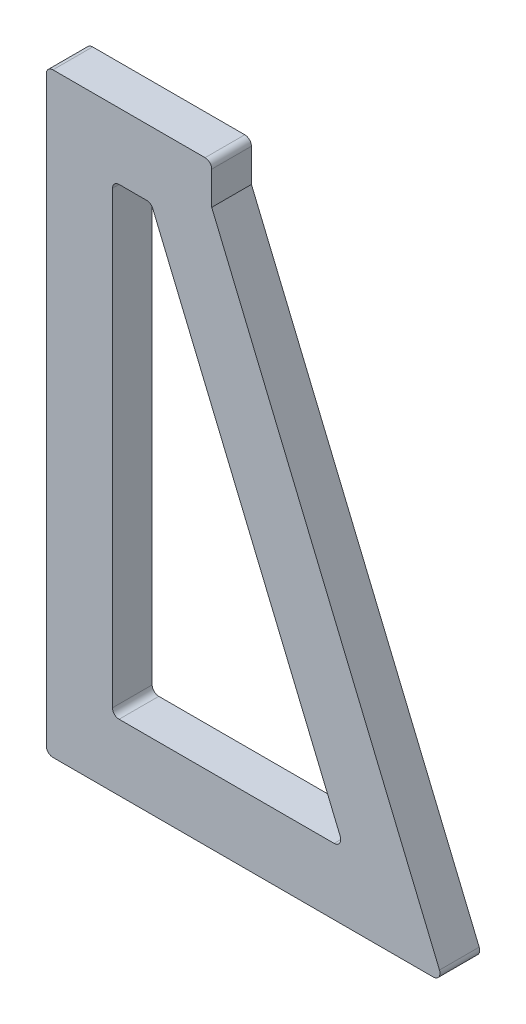
ISO-10303-21;
HEADER;
FILE_DESCRIPTION(('STEP AP214'),'2;1');
FILE_NAME('part.step','',(''),(''),'','','');
FILE_SCHEMA(('AUTOMOTIVE_DESIGN { 1 0 10303 214 1 1 1 1 }'));
ENDSEC;
DATA;
#1=APPLICATION_CONTEXT('core data for automotive mechanical design processes');
#2=APPLICATION_PROTOCOL_DEFINITION('international standard','automotive_design',2000,#1);
#3=PRODUCT_CONTEXT('',#1,'mechanical');
#4=PRODUCT('Part','Part','',(#3));
#5=PRODUCT_RELATED_PRODUCT_CATEGORY('part','',(#4));
#6=PRODUCT_DEFINITION_FORMATION('','',#4);
#7=PRODUCT_DEFINITION_CONTEXT('part definition',#1,'design');
#8=PRODUCT_DEFINITION('design','',#6,#7);
#9=PRODUCT_DEFINITION_SHAPE('','',#8);
#10=(LENGTH_UNIT() NAMED_UNIT(*) SI_UNIT(.MILLI.,.METRE.));
#11=(NAMED_UNIT(*) PLANE_ANGLE_UNIT() SI_UNIT($,.RADIAN.));
#12=(NAMED_UNIT(*) SI_UNIT($,.STERADIAN.) SOLID_ANGLE_UNIT());
#13=UNCERTAINTY_MEASURE_WITH_UNIT(LENGTH_MEASURE(1.E-05),#10,'distance_accuracy_value','');
#14=(GEOMETRIC_REPRESENTATION_CONTEXT(3) GLOBAL_UNCERTAINTY_ASSIGNED_CONTEXT((#13)) GLOBAL_UNIT_ASSIGNED_CONTEXT((#10,
#11,#12)) REPRESENTATION_CONTEXT('',''));
#15=CARTESIAN_POINT('',(0.,0.,0.));
#16=DIRECTION('',(0.,0.,1.));
#17=DIRECTION('',(1.,0.,0.));
#18=AXIS2_PLACEMENT_3D('',#15,#16,#17);
#19=CARTESIAN_POINT('',(58.5,1.,6.));
#20=DIRECTION('',(0.,0.,-1.));
#21=DIRECTION('',(-1.,0.,0.));
#22=AXIS2_PLACEMENT_3D('',#19,#20,#21);
#23=PLANE('',#22);
#24=DIRECTION('',(-0.384615384615385,0.923076923076923,0.));
#25=VECTOR('',#24,1.);
#26=CARTESIAN_POINT('',(25.,84.,6.));
#27=LINE('',#26,#25);
#28=CARTESIAN_POINT('',(59.4230769230769,1.38461538461538,6.));
#29=VERTEX_POINT('',#28);
#30=CARTESIAN_POINT('',(25.,84.,6.));
#31=VERTEX_POINT('',#30);
#32=EDGE_CURVE('E217',#29,#31,#27,.T.);
#33=ORIENTED_EDGE('',*,*,#32,.T.);
#34=DIRECTION('',(0.,1.,0.));
#35=VECTOR('',#34,1.);
#36=CARTESIAN_POINT('',(25.,89.,6.));
#37=LINE('',#36,#35);
#38=CARTESIAN_POINT('',(25.,89.,6.));
#39=VERTEX_POINT('',#38);
#40=EDGE_CURVE('E220',#31,#39,#37,.T.);
#41=ORIENTED_EDGE('',*,*,#40,.T.);
#42=CARTESIAN_POINT('',(24.,89.,6.));
#43=DIRECTION('',(0.,0.,1.));
#44=DIRECTION('',(1.,0.,0.));
#45=AXIS2_PLACEMENT_3D('',#42,#43,#44);
#46=CIRCLE('',#45,0.999999999999999);
#47=CARTESIAN_POINT('',(24.,90.,6.));
#48=VERTEX_POINT('',#47);
#49=EDGE_CURVE('E223',#39,#48,#46,.T.);
#50=ORIENTED_EDGE('',*,*,#49,.T.);
#51=DIRECTION('',(-1.,0.,0.));
#52=VECTOR('',#51,1.);
#53=CARTESIAN_POINT('',(1.,90.,6.));
#54=LINE('',#53,#52);
#55=CARTESIAN_POINT('',(1.,90.,6.));
#56=VERTEX_POINT('',#55);
#57=EDGE_CURVE('E225',#48,#56,#54,.T.);
#58=ORIENTED_EDGE('',*,*,#57,.T.);
#59=CARTESIAN_POINT('',(1.,89.,6.));
#60=DIRECTION('',(0.,0.,1.));
#61=DIRECTION('',(-1.,0.,0.));
#62=AXIS2_PLACEMENT_3D('',#59,#60,#61);
#63=CIRCLE('',#62,1.);
#64=CARTESIAN_POINT('',(0.,89.,6.));
#65=VERTEX_POINT('',#64);
#66=EDGE_CURVE('E227',#56,#65,#63,.T.);
#67=ORIENTED_EDGE('',*,*,#66,.T.);
#68=DIRECTION('',(0.,-1.,0.));
#69=VECTOR('',#68,1.);
#70=CARTESIAN_POINT('',(0.,1.00000000000001,6.));
#71=LINE('',#70,#69);
#72=CARTESIAN_POINT('',(0.,1.00000000000001,6.));
#73=VERTEX_POINT('',#72);
#74=EDGE_CURVE('E229',#65,#73,#71,.T.);
#75=ORIENTED_EDGE('',*,*,#74,.T.);
#76=CARTESIAN_POINT('',(1.,1.,6.));
#77=DIRECTION('',(0.,0.,1.));
#78=DIRECTION('',(1.,0.,0.));
#79=AXIS2_PLACEMENT_3D('',#76,#77,#78);
#80=CIRCLE('',#79,1.);
#81=CARTESIAN_POINT('',(1.00000000000001,0.,6.));
#82=VERTEX_POINT('',#81);
#83=EDGE_CURVE('E231',#73,#82,#80,.T.);
#84=ORIENTED_EDGE('',*,*,#83,.T.);
#85=DIRECTION('',(1.,0.,0.));
#86=VECTOR('',#85,1.);
#87=CARTESIAN_POINT('',(58.5,0.,6.));
#88=LINE('',#87,#86);
#89=CARTESIAN_POINT('',(58.5,0.,6.));
#90=VERTEX_POINT('',#89);
#91=EDGE_CURVE('E233',#82,#90,#88,.T.);
#92=ORIENTED_EDGE('',*,*,#91,.T.);
#93=CARTESIAN_POINT('',(58.5,1.,6.));
#94=DIRECTION('',(0.,0.,1.));
#95=DIRECTION('',(-1.,0.,0.));
#96=AXIS2_PLACEMENT_3D('',#93,#94,#95);
#97=CIRCLE('',#96,1.);
#98=EDGE_CURVE('E235',#90,#29,#97,.T.);
#99=ORIENTED_EDGE('',*,*,#98,.T.);
#100=EDGE_LOOP('',(#33,#41,#50,#58,#67,#75,#84,#92,#99));
#101=FACE_BOUND('',#100,.T.);
#102=CARTESIAN_POINT('',(11.,11.,6.));
#103=DIRECTION('',(0.,0.,1.));
#104=DIRECTION('',(-1.,0.,0.));
#105=AXIS2_PLACEMENT_3D('',#102,#103,#104);
#106=CIRCLE('',#105,1.);
#107=CARTESIAN_POINT('',(9.99999999999999,11.,6.));
#108=VERTEX_POINT('',#107);
#109=CARTESIAN_POINT('',(11.,9.99999999999999,6.));
#110=VERTEX_POINT('',#109);
#111=EDGE_CURVE('E152',#108,#110,#106,.T.);
#112=ORIENTED_EDGE('',*,*,#111,.F.);
#113=DIRECTION('',(0.,-1.,0.));
#114=VECTOR('',#113,1.);
#115=CARTESIAN_POINT('',(9.99999999999999,11.,6.));
#116=LINE('',#115,#114);
#117=CARTESIAN_POINT('',(10.,79.,6.));
#118=VERTEX_POINT('',#117);
#119=EDGE_CURVE('E185',#118,#108,#116,.T.);
#120=ORIENTED_EDGE('',*,*,#119,.F.);
#121=CARTESIAN_POINT('',(11.,79.,6.));
#122=DIRECTION('',(0.,0.,1.));
#123=DIRECTION('',(1.,0.,0.));
#124=AXIS2_PLACEMENT_3D('',#121,#122,#123);
#125=CIRCLE('',#124,1.);
#126=CARTESIAN_POINT('',(11.,80.,6.));
#127=VERTEX_POINT('',#126);
#128=EDGE_CURVE('E183',#127,#118,#125,.T.);
#129=ORIENTED_EDGE('',*,*,#128,.F.);
#130=DIRECTION('',(-1.,0.,0.));
#131=VECTOR('',#130,1.);
#132=CARTESIAN_POINT('',(11.,80.,6.));
#133=LINE('',#132,#131);
#134=CARTESIAN_POINT('',(15.1666666666667,80.,6.));
#135=VERTEX_POINT('',#134);
#136=EDGE_CURVE('E181',#135,#127,#133,.T.);
#137=ORIENTED_EDGE('',*,*,#136,.F.);
#138=CARTESIAN_POINT('',(15.1666666666667,79.,6.));
#139=DIRECTION('',(0.,0.,1.));
#140=DIRECTION('',(1.,0.,0.));
#141=AXIS2_PLACEMENT_3D('',#138,#139,#140);
#142=CIRCLE('',#141,1.00000000000001);
#143=CARTESIAN_POINT('',(16.0897435897436,79.3846153846154,6.));
#144=VERTEX_POINT('',#143);
#145=EDGE_CURVE('E179',#144,#135,#142,.T.);
#146=ORIENTED_EDGE('',*,*,#145,.F.);
#147=DIRECTION('',(-0.384615384615385,0.923076923076923,0.));
#148=VECTOR('',#147,1.);
#149=CARTESIAN_POINT('',(16.0897435897436,79.3846153846154,6.));
#150=LINE('',#149,#148);
#151=CARTESIAN_POINT('',(44.4230769230769,11.3846153846154,6.));
#152=VERTEX_POINT('',#151);
#153=EDGE_CURVE('E175',#152,#144,#150,.T.);
#154=ORIENTED_EDGE('',*,*,#153,.F.);
#155=CARTESIAN_POINT('',(43.5,11.,6.));
#156=DIRECTION('',(0.,0.,1.));
#157=DIRECTION('',(1.,0.,0.));
#158=AXIS2_PLACEMENT_3D('',#155,#156,#157);
#159=CIRCLE('',#158,1.);
#160=CARTESIAN_POINT('',(43.5,9.99999999999999,6.));
#161=VERTEX_POINT('',#160);
#162=EDGE_CURVE('E173',#161,#152,#159,.T.);
#163=ORIENTED_EDGE('',*,*,#162,.F.);
#164=DIRECTION('',(1.,0.,0.));
#165=VECTOR('',#164,1.);
#166=CARTESIAN_POINT('',(43.5,9.99999999999999,6.));
#167=LINE('',#166,#165);
#168=EDGE_CURVE('E160',#110,#161,#167,.T.);
#169=ORIENTED_EDGE('',*,*,#168,.F.);
#170=EDGE_LOOP('',(#112,#120,#129,#137,#146,#154,#163,#169));
#171=FACE_BOUND('',#170,.T.);
#172=ADVANCED_FACE('F33',(#101,#171),#23,.F.);
#173=CARTESIAN_POINT('',(58.5,1.,0.));
#174=DIRECTION('',(0.,0.,-1.));
#175=DIRECTION('',(-1.,0.,0.));
#176=AXIS2_PLACEMENT_3D('',#173,#174,#175);
#177=PLANE('',#176);
#178=DIRECTION('',(-0.384615384615385,0.923076923076923,0.));
#179=VECTOR('',#178,1.);
#180=CARTESIAN_POINT('',(25.,84.,0.));
#181=LINE('',#180,#179);
#182=CARTESIAN_POINT('',(59.4230769230769,1.38461538461538,0.));
#183=VERTEX_POINT('',#182);
#184=CARTESIAN_POINT('',(25.,84.,0.));
#185=VERTEX_POINT('',#184);
#186=EDGE_CURVE('E168',#183,#185,#181,.T.);
#187=ORIENTED_EDGE('',*,*,#186,.F.);
#188=CARTESIAN_POINT('',(58.5,1.,0.));
#189=DIRECTION('',(0.,0.,1.));
#190=DIRECTION('',(-1.,0.,0.));
#191=AXIS2_PLACEMENT_3D('',#188,#189,#190);
#192=CIRCLE('',#191,1.);
#193=CARTESIAN_POINT('',(58.5,0.,0.));
#194=VERTEX_POINT('',#193);
#195=EDGE_CURVE('E221',#194,#183,#192,.T.);
#196=ORIENTED_EDGE('',*,*,#195,.F.);
#197=DIRECTION('',(1.,0.,0.));
#198=VECTOR('',#197,1.);
#199=CARTESIAN_POINT('',(58.5,0.,0.));
#200=LINE('',#199,#198);
#201=CARTESIAN_POINT('',(1.00000000000001,0.,0.));
#202=VERTEX_POINT('',#201);
#203=EDGE_CURVE('E252',#202,#194,#200,.T.);
#204=ORIENTED_EDGE('',*,*,#203,.F.);
#205=CARTESIAN_POINT('',(1.,1.,0.));
#206=DIRECTION('',(0.,0.,1.));
#207=DIRECTION('',(1.,0.,0.));
#208=AXIS2_PLACEMENT_3D('',#205,#206,#207);
#209=CIRCLE('',#208,1.);
#210=CARTESIAN_POINT('',(0.,1.00000000000001,0.));
#211=VERTEX_POINT('',#210);
#212=EDGE_CURVE('E250',#211,#202,#209,.T.);
#213=ORIENTED_EDGE('',*,*,#212,.F.);
#214=DIRECTION('',(0.,-1.,0.));
#215=VECTOR('',#214,1.);
#216=CARTESIAN_POINT('',(0.,1.00000000000001,0.));
#217=LINE('',#216,#215);
#218=CARTESIAN_POINT('',(0.,89.,0.));
#219=VERTEX_POINT('',#218);
#220=EDGE_CURVE('E248',#219,#211,#217,.T.);
#221=ORIENTED_EDGE('',*,*,#220,.F.);
#222=CARTESIAN_POINT('',(1.,89.,0.));
#223=DIRECTION('',(0.,0.,1.));
#224=DIRECTION('',(-1.,0.,0.));
#225=AXIS2_PLACEMENT_3D('',#222,#223,#224);
#226=CIRCLE('',#225,1.);
#227=CARTESIAN_POINT('',(1.,90.,0.));
#228=VERTEX_POINT('',#227);
#229=EDGE_CURVE('E246',#228,#219,#226,.T.);
#230=ORIENTED_EDGE('',*,*,#229,.F.);
#231=DIRECTION('',(-1.,0.,0.));
#232=VECTOR('',#231,1.);
#233=CARTESIAN_POINT('',(1.,90.,0.));
#234=LINE('',#233,#232);
#235=CARTESIAN_POINT('',(24.,90.,0.));
#236=VERTEX_POINT('',#235);
#237=EDGE_CURVE('E244',#236,#228,#234,.T.);
#238=ORIENTED_EDGE('',*,*,#237,.F.);
#239=CARTESIAN_POINT('',(24.,89.,0.));
#240=DIRECTION('',(0.,0.,1.));
#241=DIRECTION('',(1.,0.,0.));
#242=AXIS2_PLACEMENT_3D('',#239,#240,#241);
#243=CIRCLE('',#242,0.999999999999999);
#244=CARTESIAN_POINT('',(25.,89.,0.));
#245=VERTEX_POINT('',#244);
#246=EDGE_CURVE('E242',#245,#236,#243,.T.);
#247=ORIENTED_EDGE('',*,*,#246,.F.);
#248=DIRECTION('',(0.,1.,0.));
#249=VECTOR('',#248,1.);
#250=CARTESIAN_POINT('',(25.,89.,0.));
#251=LINE('',#250,#249);
#252=EDGE_CURVE('E240',#185,#245,#251,.T.);
#253=ORIENTED_EDGE('',*,*,#252,.F.);
#254=EDGE_LOOP('',(#187,#196,#204,#213,#221,#230,#238,#247,#253));
#255=FACE_BOUND('',#254,.T.);
#256=DIRECTION('',(0.,-1.,0.));
#257=VECTOR('',#256,1.);
#258=CARTESIAN_POINT('',(9.99999999999999,11.,0.));
#259=LINE('',#258,#257);
#260=CARTESIAN_POINT('',(10.,79.,0.));
#261=VERTEX_POINT('',#260);
#262=CARTESIAN_POINT('',(10.,11.,0.));
#263=VERTEX_POINT('',#262);
#264=EDGE_CURVE('E161',#261,#263,#259,.T.);
#265=ORIENTED_EDGE('',*,*,#264,.T.);
#266=CARTESIAN_POINT('',(11.,11.,0.));
#267=DIRECTION('',(0.,0.,1.));
#268=DIRECTION('',(-1.,0.,0.));
#269=AXIS2_PLACEMENT_3D('',#266,#267,#268);
#270=CIRCLE('',#269,1.);
#271=CARTESIAN_POINT('',(11.,9.99999999999999,0.));
#272=VERTEX_POINT('',#271);
#273=EDGE_CURVE('E56',#263,#272,#270,.T.);
#274=ORIENTED_EDGE('',*,*,#273,.T.);
#275=DIRECTION('',(1.,0.,0.));
#276=VECTOR('',#275,1.);
#277=CARTESIAN_POINT('',(43.5,9.99999999999999,0.));
#278=LINE('',#277,#276);
#279=CARTESIAN_POINT('',(43.5,9.99999999999999,0.));
#280=VERTEX_POINT('',#279);
#281=EDGE_CURVE('E167',#272,#280,#278,.T.);
#282=ORIENTED_EDGE('',*,*,#281,.T.);
#283=CARTESIAN_POINT('',(43.5,11.,0.));
#284=DIRECTION('',(0.,0.,1.));
#285=DIRECTION('',(1.,0.,0.));
#286=AXIS2_PLACEMENT_3D('',#283,#284,#285);
#287=CIRCLE('',#286,1.);
#288=CARTESIAN_POINT('',(44.4230769230769,11.3846153846154,0.));
#289=VERTEX_POINT('',#288);
#290=EDGE_CURVE('E189',#280,#289,#287,.T.);
#291=ORIENTED_EDGE('',*,*,#290,.T.);
#292=DIRECTION('',(-0.384615384615385,0.923076923076923,0.));
#293=VECTOR('',#292,1.);
#294=CARTESIAN_POINT('',(16.0897435897436,79.3846153846154,0.));
#295=LINE('',#294,#293);
#296=CARTESIAN_POINT('',(16.0897435897436,79.3846153846154,0.));
#297=VERTEX_POINT('',#296);
#298=EDGE_CURVE('E192',#289,#297,#295,.T.);
#299=ORIENTED_EDGE('',*,*,#298,.T.);
#300=CARTESIAN_POINT('',(15.1666666666667,79.,0.));
#301=DIRECTION('',(0.,0.,1.));
#302=DIRECTION('',(1.,0.,0.));
#303=AXIS2_PLACEMENT_3D('',#300,#301,#302);
#304=CIRCLE('',#303,1.00000000000001);
#305=CARTESIAN_POINT('',(15.1666666666667,80.,0.));
#306=VERTEX_POINT('',#305);
#307=EDGE_CURVE('E195',#297,#306,#304,.T.);
#308=ORIENTED_EDGE('',*,*,#307,.T.);
#309=DIRECTION('',(-1.,0.,0.));
#310=VECTOR('',#309,1.);
#311=CARTESIAN_POINT('',(11.,80.,0.));
#312=LINE('',#311,#310);
#313=CARTESIAN_POINT('',(11.,80.,0.));
#314=VERTEX_POINT('',#313);
#315=EDGE_CURVE('E198',#306,#314,#312,.T.);
#316=ORIENTED_EDGE('',*,*,#315,.T.);
#317=CARTESIAN_POINT('',(11.,79.,0.));
#318=DIRECTION('',(0.,0.,1.));
#319=DIRECTION('',(1.,0.,0.));
#320=AXIS2_PLACEMENT_3D('',#317,#318,#319);
#321=CIRCLE('',#320,1.);
#322=EDGE_CURVE('E201',#314,#261,#321,.T.);
#323=ORIENTED_EDGE('',*,*,#322,.T.);
#324=EDGE_LOOP('',(#265,#274,#282,#291,#299,#308,#316,#323));
#325=FACE_BOUND('',#324,.T.);
#326=ADVANCED_FACE('F285',(#255,#325),#177,.T.);
#327=CARTESIAN_POINT('',(25.,84.,6.));
#328=DIRECTION('',(-0.923076923076923,-0.384615384615385,0.));
#329=DIRECTION('',(0.384615384615385,-0.923076923076923,0.));
#330=AXIS2_PLACEMENT_3D('',#327,#328,#329);
#331=PLANE('',#330);
#332=ORIENTED_EDGE('',*,*,#186,.T.);
#333=DIRECTION('',(0.,0.,-1.));
#334=VECTOR('',#333,1.);
#335=CARTESIAN_POINT('',(25.,84.,6.));
#336=LINE('',#335,#334);
#337=EDGE_CURVE('E11',#31,#185,#336,.T.);
#338=ORIENTED_EDGE('',*,*,#337,.F.);
#339=ORIENTED_EDGE('',*,*,#32,.F.);
#340=DIRECTION('',(0.,0.,-1.));
#341=VECTOR('',#340,1.);
#342=CARTESIAN_POINT('',(59.4230769230769,1.38461538461538,6.));
#343=LINE('',#342,#341);
#344=EDGE_CURVE('E237',#29,#183,#343,.T.);
#345=ORIENTED_EDGE('',*,*,#344,.T.);
#346=EDGE_LOOP('',(#332,#338,#339,#345));
#347=FACE_BOUND('',#346,.T.);
#348=ADVANCED_FACE('F35',(#347),#331,.F.);
#349=CARTESIAN_POINT('',(25.,89.,6.));
#350=DIRECTION('',(-1.,0.,0.));
#351=DIRECTION('',(0.,0.,1.));
#352=AXIS2_PLACEMENT_3D('',#349,#350,#351);
#353=PLANE('',#352);
#354=ORIENTED_EDGE('',*,*,#252,.T.);
#355=DIRECTION('',(0.,0.,-1.));
#356=VECTOR('',#355,1.);
#357=CARTESIAN_POINT('',(25.,89.,6.));
#358=LINE('',#357,#356);
#359=EDGE_CURVE('E41',#39,#245,#358,.T.);
#360=ORIENTED_EDGE('',*,*,#359,.F.);
#361=ORIENTED_EDGE('',*,*,#40,.F.);
#362=ORIENTED_EDGE('',*,*,#337,.T.);
#363=EDGE_LOOP('',(#354,#360,#361,#362));
#364=FACE_BOUND('',#363,.T.);
#365=ADVANCED_FACE('F302',(#364),#353,.F.);
#366=CARTESIAN_POINT('',(24.,89.,6.));
#367=DIRECTION('',(0.,0.,-1.));
#368=DIRECTION('',(-1.,0.,0.));
#369=AXIS2_PLACEMENT_3D('',#366,#367,#368);
#370=CYLINDRICAL_SURFACE('',#369,0.999999999999999);
#371=ORIENTED_EDGE('',*,*,#246,.T.);
#372=DIRECTION('',(0.,0.,-1.));
#373=VECTOR('',#372,1.);
#374=CARTESIAN_POINT('',(24.,90.,6.));
#375=LINE('',#374,#373);
#376=EDGE_CURVE('E272',#48,#236,#375,.T.);
#377=ORIENTED_EDGE('',*,*,#376,.F.);
#378=ORIENTED_EDGE('',*,*,#49,.F.);
#379=ORIENTED_EDGE('',*,*,#359,.T.);
#380=EDGE_LOOP('',(#371,#377,#378,#379));
#381=FACE_BOUND('',#380,.T.);
#382=ADVANCED_FACE('F279',(#381),#370,.T.);
#383=CARTESIAN_POINT('',(1.,90.,6.));
#384=DIRECTION('',(0.,-1.,0.));
#385=DIRECTION('',(0.,0.,-1.));
#386=AXIS2_PLACEMENT_3D('',#383,#384,#385);
#387=PLANE('',#386);
#388=ORIENTED_EDGE('',*,*,#237,.T.);
#389=DIRECTION('',(0.,0.,-1.));
#390=VECTOR('',#389,1.);
#391=CARTESIAN_POINT('',(1.,90.,6.));
#392=LINE('',#391,#390);
#393=EDGE_CURVE('E269',#56,#228,#392,.T.);
#394=ORIENTED_EDGE('',*,*,#393,.F.);
#395=ORIENTED_EDGE('',*,*,#57,.F.);
#396=ORIENTED_EDGE('',*,*,#376,.T.);
#397=EDGE_LOOP('',(#388,#394,#395,#396));
#398=FACE_BOUND('',#397,.T.);
#399=ADVANCED_FACE('F291',(#398),#387,.F.);
#400=CARTESIAN_POINT('',(1.,89.,6.));
#401=DIRECTION('',(0.,0.,-1.));
#402=DIRECTION('',(-1.,0.,0.));
#403=AXIS2_PLACEMENT_3D('',#400,#401,#402);
#404=CYLINDRICAL_SURFACE('',#403,1.);
#405=ORIENTED_EDGE('',*,*,#229,.T.);
#406=DIRECTION('',(0.,0.,-1.));
#407=VECTOR('',#406,1.);
#408=CARTESIAN_POINT('',(0.,89.,6.));
#409=LINE('',#408,#407);
#410=EDGE_CURVE('E266',#65,#219,#409,.T.);
#411=ORIENTED_EDGE('',*,*,#410,.F.);
#412=ORIENTED_EDGE('',*,*,#66,.F.);
#413=ORIENTED_EDGE('',*,*,#393,.T.);
#414=EDGE_LOOP('',(#405,#411,#412,#413));
#415=FACE_BOUND('',#414,.T.);
#416=ADVANCED_FACE('F295',(#415),#404,.T.);
#417=CARTESIAN_POINT('',(0.,1.00000000000001,6.));
#418=DIRECTION('',(1.,0.,0.));
#419=DIRECTION('',(0.,0.,-1.));
#420=AXIS2_PLACEMENT_3D('',#417,#418,#419);
#421=PLANE('',#420);
#422=ORIENTED_EDGE('',*,*,#220,.T.);
#423=DIRECTION('',(0.,0.,-1.));
#424=VECTOR('',#423,1.);
#425=CARTESIAN_POINT('',(0.,1.00000000000001,6.));
#426=LINE('',#425,#424);
#427=EDGE_CURVE('E263',#73,#211,#426,.T.);
#428=ORIENTED_EDGE('',*,*,#427,.F.);
#429=ORIENTED_EDGE('',*,*,#74,.F.);
#430=ORIENTED_EDGE('',*,*,#410,.T.);
#431=EDGE_LOOP('',(#422,#428,#429,#430));
#432=FACE_BOUND('',#431,.T.);
#433=ADVANCED_FACE('F320',(#432),#421,.F.);
#434=CARTESIAN_POINT('',(1.,1.,6.));
#435=DIRECTION('',(0.,0.,-1.));
#436=DIRECTION('',(-1.,0.,0.));
#437=AXIS2_PLACEMENT_3D('',#434,#435,#436);
#438=CYLINDRICAL_SURFACE('',#437,1.);
#439=ORIENTED_EDGE('',*,*,#212,.T.);
#440=DIRECTION('',(0.,0.,-1.));
#441=VECTOR('',#440,1.);
#442=CARTESIAN_POINT('',(1.00000000000001,0.,6.));
#443=LINE('',#442,#441);
#444=EDGE_CURVE('E260',#82,#202,#443,.T.);
#445=ORIENTED_EDGE('',*,*,#444,.F.);
#446=ORIENTED_EDGE('',*,*,#83,.F.);
#447=ORIENTED_EDGE('',*,*,#427,.T.);
#448=EDGE_LOOP('',(#439,#445,#446,#447));
#449=FACE_BOUND('',#448,.T.);
#450=ADVANCED_FACE('F318',(#449),#438,.T.);
#451=CARTESIAN_POINT('',(58.5,0.,6.));
#452=DIRECTION('',(0.,1.,0.));
#453=DIRECTION('',(-1.,0.,0.));
#454=AXIS2_PLACEMENT_3D('',#451,#452,#453);
#455=PLANE('',#454);
#456=ORIENTED_EDGE('',*,*,#203,.T.);
#457=DIRECTION('',(0.,0.,-1.));
#458=VECTOR('',#457,1.);
#459=CARTESIAN_POINT('',(58.5,0.,6.));
#460=LINE('',#459,#458);
#461=EDGE_CURVE('E257',#90,#194,#460,.T.);
#462=ORIENTED_EDGE('',*,*,#461,.F.);
#463=ORIENTED_EDGE('',*,*,#91,.F.);
#464=ORIENTED_EDGE('',*,*,#444,.T.);
#465=EDGE_LOOP('',(#456,#462,#463,#464));
#466=FACE_BOUND('',#465,.T.);
#467=ADVANCED_FACE('F314',(#466),#455,.F.);
#468=CARTESIAN_POINT('',(58.5,1.,6.));
#469=DIRECTION('',(0.,0.,-1.));
#470=DIRECTION('',(-1.,0.,0.));
#471=AXIS2_PLACEMENT_3D('',#468,#469,#470);
#472=CYLINDRICAL_SURFACE('',#471,1.);
#473=ORIENTED_EDGE('',*,*,#195,.T.);
#474=ORIENTED_EDGE('',*,*,#344,.F.);
#475=ORIENTED_EDGE('',*,*,#98,.F.);
#476=ORIENTED_EDGE('',*,*,#461,.T.);
#477=EDGE_LOOP('',(#473,#474,#475,#476));
#478=FACE_BOUND('',#477,.T.);
#479=ADVANCED_FACE('F309',(#478),#472,.T.);
#480=CARTESIAN_POINT('',(11.,11.,6.));
#481=DIRECTION('',(0.,0.,-1.));
#482=DIRECTION('',(-1.,0.,0.));
#483=AXIS2_PLACEMENT_3D('',#480,#481,#482);
#484=CYLINDRICAL_SURFACE('',#483,1.);
#485=ORIENTED_EDGE('',*,*,#273,.F.);
#486=DIRECTION('',(0.,0.,-1.));
#487=VECTOR('',#486,1.);
#488=CARTESIAN_POINT('',(9.99999999999999,11.,6.));
#489=LINE('',#488,#487);
#490=EDGE_CURVE('E156',#108,#263,#489,.T.);
#491=ORIENTED_EDGE('',*,*,#490,.F.);
#492=ORIENTED_EDGE('',*,*,#111,.T.);
#493=DIRECTION('',(0.,0.,-1.));
#494=VECTOR('',#493,1.);
#495=CARTESIAN_POINT('',(11.,9.99999999999999,6.));
#496=LINE('',#495,#494);
#497=EDGE_CURVE('E155',#110,#272,#496,.T.);
#498=ORIENTED_EDGE('',*,*,#497,.T.);
#499=EDGE_LOOP('',(#485,#491,#492,#498));
#500=FACE_BOUND('',#499,.T.);
#501=ADVANCED_FACE('F154',(#500),#484,.F.);
#502=CARTESIAN_POINT('',(43.5,9.99999999999999,6.));
#503=DIRECTION('',(0.,1.,0.));
#504=DIRECTION('',(-1.,0.,0.));
#505=AXIS2_PLACEMENT_3D('',#502,#503,#504);
#506=PLANE('',#505);
#507=ORIENTED_EDGE('',*,*,#281,.F.);
#508=ORIENTED_EDGE('',*,*,#497,.F.);
#509=ORIENTED_EDGE('',*,*,#168,.T.);
#510=DIRECTION('',(0.,0.,-1.));
#511=VECTOR('',#510,1.);
#512=CARTESIAN_POINT('',(43.5,9.99999999999999,6.));
#513=LINE('',#512,#511);
#514=EDGE_CURVE('E169',#161,#280,#513,.T.);
#515=ORIENTED_EDGE('',*,*,#514,.T.);
#516=EDGE_LOOP('',(#507,#508,#509,#515));
#517=FACE_BOUND('',#516,.T.);
#518=ADVANCED_FACE('F164',(#517),#506,.T.);
#519=CARTESIAN_POINT('',(43.5,11.,6.));
#520=DIRECTION('',(0.,0.,-1.));
#521=DIRECTION('',(-1.,0.,0.));
#522=AXIS2_PLACEMENT_3D('',#519,#520,#521);
#523=CYLINDRICAL_SURFACE('',#522,1.);
#524=ORIENTED_EDGE('',*,*,#290,.F.);
#525=ORIENTED_EDGE('',*,*,#514,.F.);
#526=ORIENTED_EDGE('',*,*,#162,.T.);
#527=DIRECTION('',(0.,0.,-1.));
#528=VECTOR('',#527,1.);
#529=CARTESIAN_POINT('',(44.4230769230769,11.3846153846154,6.));
#530=LINE('',#529,#528);
#531=EDGE_CURVE('E214',#152,#289,#530,.T.);
#532=ORIENTED_EDGE('',*,*,#531,.T.);
#533=EDGE_LOOP('',(#524,#525,#526,#532));
#534=FACE_BOUND('',#533,.T.);
#535=ADVANCED_FACE('F360',(#534),#523,.F.);
#536=CARTESIAN_POINT('',(16.0897435897436,79.3846153846154,6.));
#537=DIRECTION('',(-0.923076923076923,-0.384615384615385,0.));
#538=DIRECTION('',(0.384615384615385,-0.923076923076923,0.));
#539=AXIS2_PLACEMENT_3D('',#536,#537,#538);
#540=PLANE('',#539);
#541=ORIENTED_EDGE('',*,*,#298,.F.);
#542=ORIENTED_EDGE('',*,*,#531,.F.);
#543=ORIENTED_EDGE('',*,*,#153,.T.);
#544=DIRECTION('',(0.,0.,-1.));
#545=VECTOR('',#544,1.);
#546=CARTESIAN_POINT('',(16.0897435897436,79.3846153846154,6.));
#547=LINE('',#546,#545);
#548=EDGE_CURVE('E212',#144,#297,#547,.T.);
#549=ORIENTED_EDGE('',*,*,#548,.T.);
#550=EDGE_LOOP('',(#541,#542,#543,#549));
#551=FACE_BOUND('',#550,.T.);
#552=ADVANCED_FACE('F366',(#551),#540,.T.);
#553=CARTESIAN_POINT('',(15.1666666666667,79.,6.));
#554=DIRECTION('',(0.,0.,-1.));
#555=DIRECTION('',(-1.,0.,0.));
#556=AXIS2_PLACEMENT_3D('',#553,#554,#555);
#557=CYLINDRICAL_SURFACE('',#556,1.00000000000001);
#558=ORIENTED_EDGE('',*,*,#307,.F.);
#559=ORIENTED_EDGE('',*,*,#548,.F.);
#560=ORIENTED_EDGE('',*,*,#145,.T.);
#561=DIRECTION('',(0.,0.,-1.));
#562=VECTOR('',#561,1.);
#563=CARTESIAN_POINT('',(15.1666666666667,80.,6.));
#564=LINE('',#563,#562);
#565=EDGE_CURVE('E210',#135,#306,#564,.T.);
#566=ORIENTED_EDGE('',*,*,#565,.T.);
#567=EDGE_LOOP('',(#558,#559,#560,#566));
#568=FACE_BOUND('',#567,.T.);
#569=ADVANCED_FACE('F374',(#568),#557,.F.);
#570=CARTESIAN_POINT('',(11.,80.,6.));
#571=DIRECTION('',(0.,-1.,0.));
#572=DIRECTION('',(1.,0.,0.));
#573=AXIS2_PLACEMENT_3D('',#570,#571,#572);
#574=PLANE('',#573);
#575=ORIENTED_EDGE('',*,*,#315,.F.);
#576=ORIENTED_EDGE('',*,*,#565,.F.);
#577=ORIENTED_EDGE('',*,*,#136,.T.);
#578=DIRECTION('',(0.,0.,-1.));
#579=VECTOR('',#578,1.);
#580=CARTESIAN_POINT('',(11.,80.,6.));
#581=LINE('',#580,#579);
#582=EDGE_CURVE('E208',#127,#314,#581,.T.);
#583=ORIENTED_EDGE('',*,*,#582,.T.);
#584=EDGE_LOOP('',(#575,#576,#577,#583));
#585=FACE_BOUND('',#584,.T.);
#586=ADVANCED_FACE('F382',(#585),#574,.T.);
#587=CARTESIAN_POINT('',(11.,79.,6.));
#588=DIRECTION('',(0.,0.,-1.));
#589=DIRECTION('',(-1.,0.,0.));
#590=AXIS2_PLACEMENT_3D('',#587,#588,#589);
#591=CYLINDRICAL_SURFACE('',#590,1.);
#592=ORIENTED_EDGE('',*,*,#322,.F.);
#593=ORIENTED_EDGE('',*,*,#582,.F.);
#594=ORIENTED_EDGE('',*,*,#128,.T.);
#595=DIRECTION('',(0.,0.,-1.));
#596=VECTOR('',#595,1.);
#597=CARTESIAN_POINT('',(10.,79.,6.));
#598=LINE('',#597,#596);
#599=EDGE_CURVE('E48',#118,#261,#598,.T.);
#600=ORIENTED_EDGE('',*,*,#599,.T.);
#601=EDGE_LOOP('',(#592,#593,#594,#600));
#602=FACE_BOUND('',#601,.T.);
#603=ADVANCED_FACE('F390',(#602),#591,.F.);
#604=CARTESIAN_POINT('',(9.99999999999999,11.,6.));
#605=DIRECTION('',(1.,0.,0.));
#606=DIRECTION('',(0.,1.,0.));
#607=AXIS2_PLACEMENT_3D('',#604,#605,#606);
#608=PLANE('',#607);
#609=ORIENTED_EDGE('',*,*,#264,.F.);
#610=ORIENTED_EDGE('',*,*,#599,.F.);
#611=ORIENTED_EDGE('',*,*,#119,.T.);
#612=ORIENTED_EDGE('',*,*,#490,.T.);
#613=EDGE_LOOP('',(#609,#610,#611,#612));
#614=FACE_BOUND('',#613,.T.);
#615=ADVANCED_FACE('F398',(#614),#608,.T.);
#616=CLOSED_SHELL('',(#172,#326,#348,#365,#382,#399,#416,#433,#450,#467,#479,#501,#518,#535,
#552,#569,#586,#603,#615));
#617=MANIFOLD_SOLID_BREP('B2',#616);
#618=ADVANCED_BREP_SHAPE_REPRESENTATION('',(#18,#617),#14);
#619=SHAPE_DEFINITION_REPRESENTATION(#9,#618);
ENDSEC;
END-ISO-10303-21;
